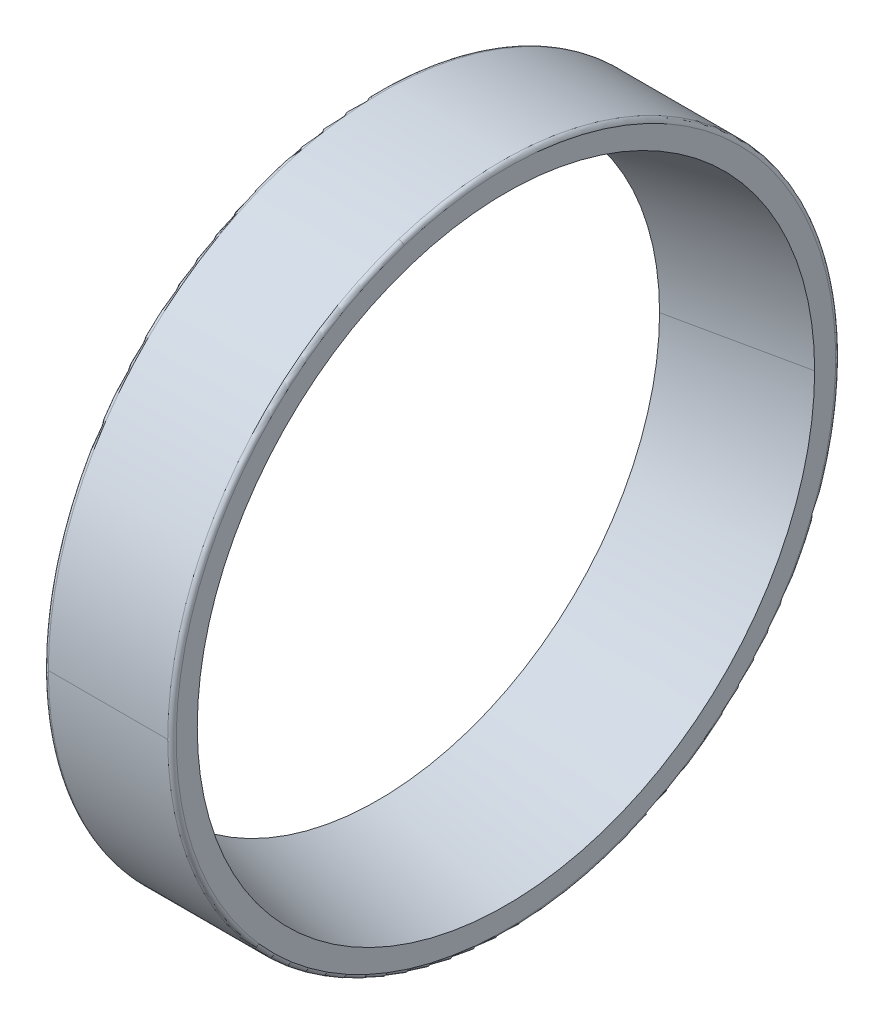
ISO-10303-21;
HEADER;
FILE_DESCRIPTION(('STEP AP214'),'2;1');
FILE_NAME('part.step','',(''),(''),'','','');
FILE_SCHEMA(('AUTOMOTIVE_DESIGN { 1 0 10303 214 1 1 1 1 }'));
ENDSEC;
DATA;
#1=APPLICATION_CONTEXT('core data for automotive mechanical design processes');
#2=APPLICATION_PROTOCOL_DEFINITION('international standard','automotive_design',2000,#1);
#3=PRODUCT_CONTEXT('',#1,'mechanical');
#4=PRODUCT('Part','Part','',(#3));
#5=PRODUCT_RELATED_PRODUCT_CATEGORY('part','',(#4));
#6=PRODUCT_DEFINITION_FORMATION('','',#4);
#7=PRODUCT_DEFINITION_CONTEXT('part definition',#1,'design');
#8=PRODUCT_DEFINITION('design','',#6,#7);
#9=PRODUCT_DEFINITION_SHAPE('','',#8);
#10=(LENGTH_UNIT() NAMED_UNIT(*) SI_UNIT(.MILLI.,.METRE.));
#11=(NAMED_UNIT(*) PLANE_ANGLE_UNIT() SI_UNIT($,.RADIAN.));
#12=(NAMED_UNIT(*) SI_UNIT($,.STERADIAN.) SOLID_ANGLE_UNIT());
#13=UNCERTAINTY_MEASURE_WITH_UNIT(LENGTH_MEASURE(1.E-05),#10,'distance_accuracy_value','');
#14=(GEOMETRIC_REPRESENTATION_CONTEXT(3) GLOBAL_UNCERTAINTY_ASSIGNED_CONTEXT((#13)) GLOBAL_UNIT_ASSIGNED_CONTEXT((#10,
#11,#12)) REPRESENTATION_CONTEXT('',''));
#15=CARTESIAN_POINT('',(0.,0.,0.));
#16=DIRECTION('',(0.,0.,1.));
#17=DIRECTION('',(1.,0.,0.));
#18=AXIS2_PLACEMENT_3D('',#15,#16,#17);
#19=CARTESIAN_POINT('',(-11.7000000000001,0.,0.));
#20=DIRECTION('',(1.,0.,0.));
#21=DIRECTION('',(0.,-0.309016994374947,0.951056516295154));
#22=AXIS2_PLACEMENT_3D('',#19,#20,#21);
#23=TOROIDAL_SURFACE('',#22,23.2,0.299999999999873);
#24=CARTESIAN_POINT('',(-11.7000000000001,-22.0645111780476,-7.16919426949878));
#25=DIRECTION('',(0.,0.309016994374946,-0.951056516295154));
#26=DIRECTION('',(3.9671969413289E-13,-0.951056516295154,-0.309016994374946));
#27=AXIS2_PLACEMENT_3D('',#24,#25,#26);
#28=CIRCLE('',#27,0.299999999999874);
#29=CARTESIAN_POINT('',(-11.7,-22.349828132936,-7.26189936781122));
#30=VERTEX_POINT('',#29);
#31=CARTESIAN_POINT('',(-12.,-22.0645111780476,-7.16919426949878));
#32=VERTEX_POINT('',#31);
#33=EDGE_CURVE('E10',#30,#32,#28,.T.);
#34=ORIENTED_EDGE('',*,*,#33,.T.);
#35=CARTESIAN_POINT('',(-12.,-22.0645111780475,-7.16919426949883));
#36=CARTESIAN_POINT('',(-12.,-21.9472130510089,-7.53022684233366));
#37=CARTESIAN_POINT('',(-12.,-21.8210390891849,-7.88837476117965));
#38=CARTESIAN_POINT('',(-12.,-21.5512765476478,-8.59805105823176));
#39=CARTESIAN_POINT('',(-12.,-21.4076879679346,-8.94957943643786));
#40=CARTESIAN_POINT('',(-12.,-21.1034332423005,-9.64516641954797));
#41=CARTESIAN_POINT('',(-12.,-20.9427670963796,-9.98922502445198));
#42=CARTESIAN_POINT('',(-12.,-20.6047466727279,-10.6690444966338));
#43=CARTESIAN_POINT('',(-12.,-20.4273923949972,-11.0048053639117));
#44=CARTESIAN_POINT('',(-12.,-20.0564223331806,-11.6672202415471));
#45=CARTESIAN_POINT('',(-12.,-19.8628065490948,-11.9938742519046));
#46=CARTESIAN_POINT('',(-12.,-19.4597800825097,-12.6372885424087));
#47=CARTESIAN_POINT('',(-12.,-19.2503694000103,-12.9540488225553));
#48=CARTESIAN_POINT('',(-12.,-18.8162575795734,-13.576912532006));
#49=CARTESIAN_POINT('',(-12.,-18.5915564416358,-13.8830159613102));
#50=CARTESIAN_POINT('',(-12.,-18.1274050472907,-14.4838285437582));
#51=CARTESIAN_POINT('',(-12.,-17.8879547908832,-14.778537696902));
#52=CARTESIAN_POINT('',(-12.,-17.3948820129581,-15.3558517456186));
#53=CARTESIAN_POINT('',(-12.,-17.1412594914406,-15.6384566411914));
#54=CARTESIAN_POINT('',(-12.,-16.6204531830436,-16.1908813551536));
#55=CARTESIAN_POINT('',(-12.,-16.3532693961642,-16.4607011735429));
#56=CARTESIAN_POINT('',(-12.,-15.8059842259532,-16.9869057134726));
#57=CARTESIAN_POINT('',(-12.,-15.5258828426215,-17.2432904350129));
#58=CARTESIAN_POINT('',(-12.,-14.9534372683355,-17.7420071280178));
#59=CARTESIAN_POINT('',(-12.,-14.6610930773811,-17.9843390994824));
#60=CARTESIAN_POINT('',(-12.,-14.0648661705951,-18.4543664933842));
#61=CARTESIAN_POINT('',(-12.,-13.7609834547634,-18.6820619158215));
#62=CARTESIAN_POINT('',(-12.,-13.1424115783068,-19.1222676734541));
#63=CARTESIAN_POINT('',(-12.,-12.8277224176817,-19.3347780086494));
#64=CARTESIAN_POINT('',(-12.,-12.1882957653886,-19.7441016357864));
#65=CARTESIAN_POINT('',(-12.,-11.8635582737205,-19.940914927728));
#66=CARTESIAN_POINT('',(-12.,-11.2048172804026,-20.3183703278988));
#67=CARTESIAN_POINT('',(-12.,-10.8708137787528,-20.4990124361279));
#68=CARTESIAN_POINT('',(-12.,-10.1943454091621,-20.8436902862124));
#69=CARTESIAN_POINT('',(-12.,-9.85188054122127,-21.0077260280677));
#70=CARTESIAN_POINT('',(-12.,-9.15931446691175,-21.3187959689348));
#71=CARTESIAN_POINT('',(-12.,-8.8092132605431,-21.4658301679465));
#72=CARTESIAN_POINT('',(-12.,-8.1022179338494,-21.742542804862));
#73=CARTESIAN_POINT('',(-12.,-7.74532381352434,-21.8722212427659));
#74=CARTESIAN_POINT('',(-12.,-7.02560244811392,-22.1139099507506));
#75=CARTESIAN_POINT('',(-12.,-6.66277520302856,-22.2259202208313));
#76=CARTESIAN_POINT('',(-12.,-5.93206167071085,-22.432002750618));
#77=CARTESIAN_POINT('',(-12.,-5.5641753834785,-22.5260750103239));
#78=CARTESIAN_POINT('',(-12.,-4.82423003715579,-22.6960548910478));
#79=CARTESIAN_POINT('',(-12.,-4.45217097806544,-22.7719625120656));
#80=CARTESIAN_POINT('',(-12.,-3.70477641088859,-22.9054302473054));
#81=CARTESIAN_POINT('',(-12.,-3.32944090280209,-22.9629903615273));
#82=CARTESIAN_POINT('',(-12.,-2.57639765374746,-23.0596244158185));
#83=CARTESIAN_POINT('',(-12.,-2.19868991277932,-23.0986983558877));
#84=CARTESIAN_POINT('',(-12.,-1.44181212899267,-23.1582659293294));
#85=CARTESIAN_POINT('',(-12.,-1.06264208617416,-23.1787595627018));
#86=CARTESIAN_POINT('',(-12.,-0.303753152531302,-23.201117151792));
#87=CARTESIAN_POINT('',(-12.,0.0759657382930412,-23.2029811075097));
#88=CARTESIAN_POINT('',(-12.,0.83503759188013,-23.1880748508581));
#89=CARTESIAN_POINT('',(-12.,1.21439055464287,-23.1713046384886));
#90=CARTESIAN_POINT('',(-12.,1.97181665759207,-23.1191704465729));
#91=CARTESIAN_POINT('',(-12.,2.34988979777853,-23.0838064670267));
#92=CARTESIAN_POINT('',(-12.,3.10384544426514,-22.9945699356818));
#93=CARTESIAN_POINT('',(-12.,3.47972795056529,-22.9406973838832));
#94=CARTESIAN_POINT('',(-12.,4.22839679539822,-22.8145734917293));
#95=CARTESIAN_POINT('',(-12.,4.60118313393098,-22.742322151374));
#96=CARTESIAN_POINT('',(-12.,5.34276156828737,-22.5796147419144));
#97=CARTESIAN_POINT('',(-12.,5.71155366411099,-22.4891586728101));
#98=CARTESIAN_POINT('',(-12.,6.44425516058787,-22.2902597224457));
#99=CARTESIAN_POINT('',(-12.,6.80816456124113,-22.1818168411857));
#100=CARTESIAN_POINT('',(-12.,7.53022397775642,-21.9472055149094));
#101=CARTESIAN_POINT('',(-12.,7.88837399361845,-21.8210370698932));
#102=CARTESIAN_POINT('',(-12.,8.59805182579284,-21.5512785669396));
#103=CARTESIAN_POINT('',(-12.,8.94957964210519,-21.4076885090022));
#104=CARTESIAN_POINT('',(-12.,9.64516621388053,-21.1034327012329));
#105=CARTESIAN_POINT('',(-12.,9.98922496934351,-20.942766951401));
#106=CARTESIAN_POINT('',(-12.,10.6690445517422,-20.6047468177066));
#107=CARTESIAN_POINT('',(-12.,11.0048053786779,-20.4273924338441));
#108=CARTESIAN_POINT('',(-12.,11.6672202267808,-20.0564222943337));
#109=CARTESIAN_POINT('',(-12.,11.9938742479479,-19.8628065386858));
#110=CARTESIAN_POINT('',(-12.,12.6372885463652,-19.4597800929187));
#111=CARTESIAN_POINT('',(-12.,12.9540488236154,-19.2503694027995));
#112=CARTESIAN_POINT('',(-12.,13.5769125309458,-18.8162575767844));
#113=CARTESIAN_POINT('',(-12.,13.8830159610261,-18.5915564408885));
#114=CARTESIAN_POINT('',(-12.,14.4838285440422,-18.1274050480381));
#115=CARTESIAN_POINT('',(-12.,14.778537696978,-17.8879547910835));
#116=CARTESIAN_POINT('',(-12.,15.3558517455424,-17.3948820127579));
#117=CARTESIAN_POINT('',(-12.,15.638456641171,-17.141259491387));
#118=CARTESIAN_POINT('',(-12.,16.1908813551739,-16.6204531830973));
#119=CARTESIAN_POINT('',(-12.,16.4607011735483,-16.3532693961787));
#120=CARTESIAN_POINT('',(-12.,16.9869057134671,-15.8059842259389));
#121=CARTESIAN_POINT('',(-12.,17.2432904350114,-15.5258828426177));
#122=CARTESIAN_POINT('',(-12.,17.7420071280193,-14.9534372683394));
#123=CARTESIAN_POINT('',(-12.,17.9843390994827,-14.6610930773822));
#124=CARTESIAN_POINT('',(-12.,18.4543664933838,-14.0648661705941));
#125=CARTESIAN_POINT('',(-12.,18.6820619158213,-13.7609834547632));
#126=CARTESIAN_POINT('',(-12.,19.1222676734541,-13.1424115783071));
#127=CARTESIAN_POINT('',(-12.,19.3347780086494,-12.8277224176819));
#128=CARTESIAN_POINT('',(-12.,19.7441016357863,-12.1882957653886));
#129=CARTESIAN_POINT('',(-12.,19.940914927728,-11.8635582737206));
#130=CARTESIAN_POINT('',(-12.,20.3183703278988,-11.2048172804027));
#131=CARTESIAN_POINT('',(-12.,20.4990124361279,-10.8708137787529));
#132=CARTESIAN_POINT('',(-12.,20.8436902862123,-10.1943454091622));
#133=CARTESIAN_POINT('',(-12.,21.0077260280677,-9.85188054122133));
#134=CARTESIAN_POINT('',(-12.,21.3187959689348,-9.1593144669118));
#135=CARTESIAN_POINT('',(-12.,21.4658301679465,-8.80921326054314));
#136=CARTESIAN_POINT('',(-12.,21.7425428048619,-8.10221793384948));
#137=CARTESIAN_POINT('',(-12.,21.8722212427656,-7.74532381352448));
#138=CARTESIAN_POINT('',(-12.,22.1139099507508,-7.02560244811391));
#139=CARTESIAN_POINT('',(-12.,22.2259202208323,-6.66277520302833));
#140=CARTESIAN_POINT('',(-12.,22.4320027506169,-5.9320616707112));
#141=CARTESIAN_POINT('',(-12.,22.5260750103199,-5.56417538347964));
#142=CARTESIAN_POINT('',(-12.,22.6960548910517,-4.82423003715478));
#143=CARTESIAN_POINT('',(-12.,22.7719625120804,-4.45217097806147));
#144=CARTESIAN_POINT('',(-12.,22.9054302472905,-3.70477641089268));
#145=CARTESIAN_POINT('',(-12.,22.9629903614719,-3.3294409028172));
#146=CARTESIAN_POINT('',(-12.,23.0596244158739,-2.57639765373249));
#147=CARTESIAN_POINT('',(-12.,23.0986983560945,-2.19868991272326));
#148=CARTESIAN_POINT('',(-12.,23.1582659291226,-1.44181212904886));
#149=CARTESIAN_POINT('',(-12.,23.1787595619302,-1.06264208638369));
#150=CARTESIAN_POINT('',(-12.,23.2011171525636,-0.30375315232193));
#151=CARTESIAN_POINT('',(-12.,23.2029811103893,0.0759657390746495));
#152=CARTESIAN_POINT('',(-12.,23.1880748479785,0.835037591098368));
#153=CARTESIAN_POINT('',(-12.,23.1713046277419,1.21439055172551));
#154=CARTESIAN_POINT('',(-12.,23.1191704573196,1.9718166605093));
#155=CARTESIAN_POINT('',(-12.,23.0838065071339,2.34988980866596));
#156=CARTESIAN_POINT('',(-12.,22.9945698955747,3.1038454333776));
#157=CARTESIAN_POINT('',(-12.,22.9406972342011,3.47972790993258));
#158=CARTESIAN_POINT('',(-12.,22.8145736414113,4.22839683603082));
#159=CARTESIAN_POINT('',(-12.,22.7423227099952,4.60118328557407));
#160=CARTESIAN_POINT('',(-12.,22.5796141832933,5.34276141664416));
#161=CARTESIAN_POINT('',(-12.,22.4891565880076,5.71155309817101));
#162=CARTESIAN_POINT('',(-12.,22.2902618072482,6.44425572652773));
#163=CARTESIAN_POINT('',(-12.,22.1818246217745,6.8081666733576));
#164=CARTESIAN_POINT('',(-12.,22.0645111780476,7.16919426949871));
#165=B_SPLINE_CURVE_WITH_KNOTS('',3,(#35,#36,#37,#38,#39,#40,#41,#42,#43,#44,#45,#46,#47,#48,
#49,#50,#51,#52,#53,#54,#55,#56,#57,#58,#59,#60,#61,#62,#63,#64,#65,#66,#67,#68,#69,#70,#71,#72,
#73,#74,#75,#76,#77,#78,#79,#80,#81,#82,#83,#84,#85,#86,#87,#88,#89,#90,#91,#92,#93,#94,#95,#96,
#97,#98,#99,#100,#101,#102,#103,#104,#105,#106,#107,#108,#109,#110,#111,#112,#113,#114,#115,
#116,#117,#118,#119,#120,#121,#122,#123,#124,#125,#126,#127,#128,#129,#130,#131,#132,#133,#134,
#135,#136,#137,#138,#139,#140,#141,#142,#143,#144,#145,#146,#147,#148,#149,#150,#151,#152,#153,
#154,#155,#156,#157,#158,#159,#160,#161,#162,#163,#164),.UNSPECIFIED.,.F.,.F.,(4,2,2,2,2,2,2,2,
2,2,2,2,2,2,2,2,2,2,2,2,2,2,2,2,2,2,2,2,2,2,2,2,2,2,2,2,2,2,2,2,2,2,2,2,2,2,2,2,2,2,2,2,2,2,2,2,
2,2,2,2,2,2,2,2,4),(0.,1.13871300346313,2.27742600692626,3.41613901038938,4.55485201385252,
5.69356501731564,6.83227802077877,7.97099102424189,9.10970402770503,10.2484170311682,
11.3871300346313,12.5258430380944,13.6645560415575,14.8032690450207,15.9419820484838,
17.0806950519469,18.21940805541,19.3581210588732,20.4968340623363,21.6355470657994,
22.7742600692626,23.9129730727257,25.0516860761888,26.1903990796519,27.3291120831151,
28.4678250865782,29.6065380900413,30.7452510935045,31.8839640969676,33.0226771004307,
34.1613901038938,35.300103107357,36.4388161108201,37.5775291142832,38.7162421177463,
39.8549551212095,40.9936681246726,42.1323811281357,43.2710941315989,44.409807135062,
45.5485201385251,46.6872331419882,47.8259461454514,48.9646591489145,50.1033721523776,
51.2420851558407,52.3807981593039,53.519511162767,54.6582241662301,55.7969371696933,
56.9356501731564,58.0743631766195,59.2130761800826,60.3517891835458,61.4905021870089,
62.629215190472,63.7679281939352,64.9066411973983,66.0453542008614,67.1840672043245,
68.3227802077877,69.4614932112508,70.6002062147139,71.7389192181771,72.8776322216402),.UNSPECIFIED.);
#166=CARTESIAN_POINT('',(-12.,22.0645111780476,7.16919426949878));
#167=VERTEX_POINT('',#166);
#168=EDGE_CURVE('E25',#32,#167,#165,.T.);
#169=ORIENTED_EDGE('',*,*,#168,.T.);
#170=CARTESIAN_POINT('',(-11.7000000000001,22.0645111780476,7.16919426949878));
#171=DIRECTION('',(0.,-0.309016994374946,0.951056516295154));
#172=DIRECTION('',(3.9671969413289E-13,0.951056516295154,0.309016994374946));
#173=AXIS2_PLACEMENT_3D('',#170,#171,#172);
#174=CIRCLE('',#173,0.299999999999874);
#175=CARTESIAN_POINT('',(-11.7,22.349828132936,7.26189936781122));
#176=VERTEX_POINT('',#175);
#177=EDGE_CURVE('E220',#176,#167,#174,.T.);
#178=ORIENTED_EDGE('',*,*,#177,.F.);
#179=CARTESIAN_POINT('',(-11.7,0.,0.));
#180=DIRECTION('',(1.,0.,0.));
#181=DIRECTION('',(0.,0.,-1.));
#182=AXIS2_PLACEMENT_3D('',#179,#180,#181);
#183=CIRCLE('',#182,23.5);
#184=CARTESIAN_POINT('',(-11.7,0.,-23.5));
#185=VERTEX_POINT('',#184);
#186=EDGE_CURVE('E215',#185,#176,#183,.T.);
#187=ORIENTED_EDGE('',*,*,#186,.F.);
#188=CARTESIAN_POINT('',(-11.7,0.,0.));
#189=DIRECTION('',(1.,0.,0.));
#190=DIRECTION('',(0.,0.,-1.));
#191=AXIS2_PLACEMENT_3D('',#188,#189,#190);
#192=CIRCLE('',#191,23.5);
#193=EDGE_CURVE('E210',#30,#185,#192,.T.);
#194=ORIENTED_EDGE('',*,*,#193,.F.);
#195=EDGE_LOOP('',(#34,#169,#178,#187,#194));
#196=FACE_BOUND('',#195,.T.);
#197=ADVANCED_FACE('F16',(#196),#23,.T.);
#198=CARTESIAN_POINT('',(-3.,0.,0.));
#199=DIRECTION('',(1.,0.,0.));
#200=DIRECTION('',(0.,1.,0.));
#201=AXIS2_PLACEMENT_3D('',#198,#199,#200);
#202=CYLINDRICAL_SURFACE('',#201,23.5);
#203=DIRECTION('',(1.,0.,0.));
#204=VECTOR('',#203,1.);
#205=CARTESIAN_POINT('',(-11.7,0.,23.5));
#206=LINE('',#205,#204);
#207=CARTESIAN_POINT('',(-11.7,0.,23.5));
#208=VERTEX_POINT('',#207);
#209=CARTESIAN_POINT('',(-3.3,0.,23.5));
#210=VERTEX_POINT('',#209);
#211=EDGE_CURVE('E205',#208,#210,#206,.T.);
#212=ORIENTED_EDGE('',*,*,#211,.F.);
#213=CARTESIAN_POINT('',(-11.7,0.,0.));
#214=DIRECTION('',(1.,0.,0.));
#215=DIRECTION('',(0.,0.,-1.));
#216=AXIS2_PLACEMENT_3D('',#213,#214,#215);
#217=CIRCLE('',#216,23.5);
#218=EDGE_CURVE('E200',#208,#30,#217,.T.);
#219=ORIENTED_EDGE('',*,*,#218,.T.);
#220=ORIENTED_EDGE('',*,*,#193,.T.);
#221=DIRECTION('',(1.,0.,0.));
#222=VECTOR('',#221,1.);
#223=CARTESIAN_POINT('',(-11.7,0.,-23.5));
#224=LINE('',#223,#222);
#225=CARTESIAN_POINT('',(-3.3,0.,-23.5));
#226=VERTEX_POINT('',#225);
#227=EDGE_CURVE('E196',#185,#226,#224,.T.);
#228=ORIENTED_EDGE('',*,*,#227,.T.);
#229=CARTESIAN_POINT('',(-3.3,0.,0.));
#230=DIRECTION('',(1.,0.,0.));
#231=DIRECTION('',(0.,0.,-1.));
#232=AXIS2_PLACEMENT_3D('',#229,#230,#231);
#233=CIRCLE('',#232,23.5);
#234=CARTESIAN_POINT('',(-3.3,-22.349828132936,-7.26189936781122));
#235=VERTEX_POINT('',#234);
#236=EDGE_CURVE('E191',#235,#226,#233,.T.);
#237=ORIENTED_EDGE('',*,*,#236,.F.);
#238=CARTESIAN_POINT('',(-3.3,0.,0.));
#239=DIRECTION('',(1.,0.,0.));
#240=DIRECTION('',(0.,0.,-1.));
#241=AXIS2_PLACEMENT_3D('',#238,#239,#240);
#242=CIRCLE('',#241,23.5);
#243=EDGE_CURVE('E186',#210,#235,#242,.T.);
#244=ORIENTED_EDGE('',*,*,#243,.F.);
#245=EDGE_LOOP('',(#212,#219,#220,#228,#237,#244));
#246=FACE_BOUND('',#245,.T.);
#247=ADVANCED_FACE('F241',(#246),#202,.T.);
#248=CARTESIAN_POINT('',(-3.29999999999988,0.,0.));
#249=DIRECTION('',(1.,0.,0.));
#250=DIRECTION('',(0.,0.309016994374947,-0.951056516295154));
#251=AXIS2_PLACEMENT_3D('',#248,#249,#250);
#252=TOROIDAL_SURFACE('',#251,23.2,0.299999999999879);
#253=CARTESIAN_POINT('',(-3.29999999999988,-22.0645111780476,-7.16919426949878));
#254=DIRECTION('',(0.,0.309016994374947,-0.951056516295154));
#255=DIRECTION('',(1.,0.,0.));
#256=AXIS2_PLACEMENT_3D('',#253,#254,#255);
#257=CIRCLE('',#256,0.299999999999879);
#258=CARTESIAN_POINT('',(-3.,-22.0645111780476,-7.16919426949878));
#259=VERTEX_POINT('',#258);
#260=EDGE_CURVE('E181',#259,#235,#257,.T.);
#261=ORIENTED_EDGE('',*,*,#260,.F.);
#262=CARTESIAN_POINT('',(-3.,0.,0.));
#263=DIRECTION('',(1.,0.,0.));
#264=DIRECTION('',(0.,0.,-1.));
#265=AXIS2_PLACEMENT_3D('',#262,#263,#264);
#266=CIRCLE('',#265,23.2);
#267=CARTESIAN_POINT('',(-3.,22.0645111780476,7.16919426949878));
#268=VERTEX_POINT('',#267);
#269=EDGE_CURVE('E176',#268,#259,#266,.T.);
#270=ORIENTED_EDGE('',*,*,#269,.F.);
#271=CARTESIAN_POINT('',(-3.29999999999988,22.0645111780476,7.16919426949878));
#272=DIRECTION('',(0.,-0.309016994374947,0.951056516295154));
#273=DIRECTION('',(1.,0.,0.));
#274=AXIS2_PLACEMENT_3D('',#271,#272,#273);
#275=CIRCLE('',#274,0.299999999999879);
#276=CARTESIAN_POINT('',(-3.3,22.349828132936,7.26189936781123));
#277=VERTEX_POINT('',#276);
#278=EDGE_CURVE('E172',#268,#277,#275,.T.);
#279=ORIENTED_EDGE('',*,*,#278,.T.);
#280=CARTESIAN_POINT('',(-3.3,0.,0.));
#281=DIRECTION('',(1.,0.,0.));
#282=DIRECTION('',(0.,0.,-1.));
#283=AXIS2_PLACEMENT_3D('',#280,#281,#282);
#284=CIRCLE('',#283,23.5);
#285=EDGE_CURVE('E167',#277,#210,#284,.T.);
#286=ORIENTED_EDGE('',*,*,#285,.T.);
#287=ORIENTED_EDGE('',*,*,#243,.T.);
#288=EDGE_LOOP('',(#261,#270,#279,#286,#287));
#289=FACE_BOUND('',#288,.T.);
#290=ADVANCED_FACE('F243',(#289),#252,.T.);
#291=CARTESIAN_POINT('',(-3.,0.,0.));
#292=DIRECTION('',(1.,0.,0.));
#293=DIRECTION('',(0.,-1.,0.));
#294=AXIS2_PLACEMENT_3D('',#291,#292,#293);
#295=CYLINDRICAL_SURFACE('',#294,23.5);
#296=ORIENTED_EDGE('',*,*,#211,.T.);
#297=ORIENTED_EDGE('',*,*,#285,.F.);
#298=CARTESIAN_POINT('',(-3.3,0.,0.));
#299=DIRECTION('',(1.,0.,0.));
#300=DIRECTION('',(0.,0.,-1.));
#301=AXIS2_PLACEMENT_3D('',#298,#299,#300);
#302=CIRCLE('',#301,23.5);
#303=EDGE_CURVE('E162',#226,#277,#302,.T.);
#304=ORIENTED_EDGE('',*,*,#303,.F.);
#305=ORIENTED_EDGE('',*,*,#227,.F.);
#306=ORIENTED_EDGE('',*,*,#186,.T.);
#307=CARTESIAN_POINT('',(-11.7,0.,0.));
#308=DIRECTION('',(1.,0.,0.));
#309=DIRECTION('',(0.,0.,-1.));
#310=AXIS2_PLACEMENT_3D('',#307,#308,#309);
#311=CIRCLE('',#310,23.5);
#312=EDGE_CURVE('E159',#176,#208,#311,.T.);
#313=ORIENTED_EDGE('',*,*,#312,.T.);
#314=EDGE_LOOP('',(#296,#297,#304,#305,#306,#313));
#315=FACE_BOUND('',#314,.T.);
#316=ADVANCED_FACE('F237',(#315),#295,.T.);
#317=CARTESIAN_POINT('',(-11.7000000000001,0.,0.));
#318=DIRECTION('',(1.,0.,0.));
#319=DIRECTION('',(0.,0.309016994374947,-0.951056516295154));
#320=AXIS2_PLACEMENT_3D('',#317,#318,#319);
#321=TOROIDAL_SURFACE('',#320,23.2,0.299999999999873);
#322=ORIENTED_EDGE('',*,*,#33,.F.);
#323=ORIENTED_EDGE('',*,*,#218,.F.);
#324=ORIENTED_EDGE('',*,*,#312,.F.);
#325=ORIENTED_EDGE('',*,*,#177,.T.);
#326=CARTESIAN_POINT('',(-12.,22.0645111780475,7.16919426949884));
#327=CARTESIAN_POINT('',(-12.,21.9472130510089,7.53022684233366));
#328=CARTESIAN_POINT('',(-12.,21.8210390891849,7.88837476117966));
#329=CARTESIAN_POINT('',(-12.,21.5512765476478,8.59805105823176));
#330=CARTESIAN_POINT('',(-12.,21.4076879679346,8.94957943643787));
#331=CARTESIAN_POINT('',(-12.,21.1034332423005,9.64516641954798));
#332=CARTESIAN_POINT('',(-12.,20.9427670963796,9.98922502445198));
#333=CARTESIAN_POINT('',(-12.,20.6047466727279,10.6690444966338));
#334=CARTESIAN_POINT('',(-12.,20.4273923949971,11.0048053639117));
#335=CARTESIAN_POINT('',(-12.,20.0564223331806,11.6672202415471));
#336=CARTESIAN_POINT('',(-12.,19.8628065490948,11.9938742519046));
#337=CARTESIAN_POINT('',(-12.,19.4597800825097,12.6372885424087));
#338=CARTESIAN_POINT('',(-12.,19.2503694000103,12.9540488225553));
#339=CARTESIAN_POINT('',(-12.,18.8162575795734,13.576912532006));
#340=CARTESIAN_POINT('',(-12.,18.5915564416358,13.8830159613102));
#341=CARTESIAN_POINT('',(-12.,18.1274050472907,14.4838285437582));
#342=CARTESIAN_POINT('',(-12.,17.8879547908832,14.778537696902));
#343=CARTESIAN_POINT('',(-12.,17.3948820129581,15.3558517456186));
#344=CARTESIAN_POINT('',(-12.,17.1412594914406,15.6384566411914));
#345=CARTESIAN_POINT('',(-12.,16.6204531830436,16.1908813551536));
#346=CARTESIAN_POINT('',(-12.,16.3532693961642,16.4607011735429));
#347=CARTESIAN_POINT('',(-12.,15.8059842259532,16.9869057134726));
#348=CARTESIAN_POINT('',(-12.,15.5258828426215,17.243290435013));
#349=CARTESIAN_POINT('',(-12.,14.9534372683355,17.7420071280179));
#350=CARTESIAN_POINT('',(-12.,14.6610930773811,17.9843390994824));
#351=CARTESIAN_POINT('',(-12.,14.0648661705951,18.4543664933842));
#352=CARTESIAN_POINT('',(-12.,13.7609834547634,18.6820619158215));
#353=CARTESIAN_POINT('',(-12.,13.1424115783067,19.1222676734541));
#354=CARTESIAN_POINT('',(-12.,12.8277224176817,19.3347780086494));
#355=CARTESIAN_POINT('',(-12.,12.1882957653886,19.7441016357864));
#356=CARTESIAN_POINT('',(-12.,11.8635582737205,19.9409149277281));
#357=CARTESIAN_POINT('',(-12.,11.2048172804026,20.3183703278988));
#358=CARTESIAN_POINT('',(-12.,10.8708137787528,20.4990124361279));
#359=CARTESIAN_POINT('',(-12.,10.1943454091621,20.8436902862124));
#360=CARTESIAN_POINT('',(-12.,9.85188054122125,21.0077260280677));
#361=CARTESIAN_POINT('',(-12.,9.15931446691173,21.3187959689348));
#362=CARTESIAN_POINT('',(-12.,8.80921326054308,21.4658301679465));
#363=CARTESIAN_POINT('',(-12.,8.10221793384937,21.742542804862));
#364=CARTESIAN_POINT('',(-12.,7.74532381352432,21.8722212427659));
#365=CARTESIAN_POINT('',(-12.,7.0256024481139,22.1139099507506));
#366=CARTESIAN_POINT('',(-12.,6.66277520302854,22.2259202208313));
#367=CARTESIAN_POINT('',(-12.,5.93206167071082,22.432002750618));
#368=CARTESIAN_POINT('',(-12.,5.56417538347848,22.526075010324));
#369=CARTESIAN_POINT('',(-12.,4.82423003715577,22.6960548910478));
#370=CARTESIAN_POINT('',(-12.,4.45217097806541,22.7719625120656));
#371=CARTESIAN_POINT('',(-12.,3.70477641088856,22.9054302473054));
#372=CARTESIAN_POINT('',(-12.,3.32944090280206,22.9629903615273));
#373=CARTESIAN_POINT('',(-12.,2.57639765374743,23.0596244158185));
#374=CARTESIAN_POINT('',(-12.,2.19868991277929,23.0986983558878));
#375=CARTESIAN_POINT('',(-12.,1.44181212899264,23.1582659293294));
#376=CARTESIAN_POINT('',(-12.,1.06264208617413,23.1787595627018));
#377=CARTESIAN_POINT('',(-12.,0.303753152531276,23.201117151792));
#378=CARTESIAN_POINT('',(-12.,-0.0759657382930713,23.2029811075097));
#379=CARTESIAN_POINT('',(-12.,-0.835037591880163,23.1880748508581));
#380=CARTESIAN_POINT('',(-12.,-1.21439055464291,23.1713046384886));
#381=CARTESIAN_POINT('',(-12.,-1.97181665759211,23.1191704465729));
#382=CARTESIAN_POINT('',(-12.,-2.34988979777857,23.0838064670267));
#383=CARTESIAN_POINT('',(-12.,-3.10384544426518,22.9945699356818));
#384=CARTESIAN_POINT('',(-12.,-3.47972795056534,22.9406973838832));
#385=CARTESIAN_POINT('',(-12.,-4.22839679539826,22.8145734917292));
#386=CARTESIAN_POINT('',(-12.,-4.60118313393103,22.742322151374));
#387=CARTESIAN_POINT('',(-12.,-5.34276156828741,22.5796147419144));
#388=CARTESIAN_POINT('',(-12.,-5.71155366411103,22.4891586728101));
#389=CARTESIAN_POINT('',(-12.,-6.44425516058791,22.2902597224457));
#390=CARTESIAN_POINT('',(-12.,-6.80816456124117,22.1818168411857));
#391=CARTESIAN_POINT('',(-12.,-7.53022397775646,21.9472055149094));
#392=CARTESIAN_POINT('',(-12.,-7.8883739936185,21.8210370698932));
#393=CARTESIAN_POINT('',(-12.,-8.59805182579288,21.5512785669396));
#394=CARTESIAN_POINT('',(-12.,-8.94957964210523,21.4076885090022));
#395=CARTESIAN_POINT('',(-12.,-9.64516621388057,21.1034327012329));
#396=CARTESIAN_POINT('',(-12.,-9.98922496934355,20.942766951401));
#397=CARTESIAN_POINT('',(-12.,-10.6690445517422,20.6047468177066));
#398=CARTESIAN_POINT('',(-12.,-11.0048053786779,20.4273924338441));
#399=CARTESIAN_POINT('',(-12.,-11.6672202267808,20.0564222943337));
#400=CARTESIAN_POINT('',(-12.,-11.993874247948,19.8628065386858));
#401=CARTESIAN_POINT('',(-12.,-12.6372885463653,19.4597800929187));
#402=CARTESIAN_POINT('',(-12.,-12.9540488236154,19.2503694027994));
#403=CARTESIAN_POINT('',(-12.,-13.5769125309458,18.8162575767844));
#404=CARTESIAN_POINT('',(-12.,-13.8830159610261,18.5915564408885));
#405=CARTESIAN_POINT('',(-12.,-14.4838285440422,18.1274050480381));
#406=CARTESIAN_POINT('',(-12.,-14.7785376969781,17.8879547910835));
#407=CARTESIAN_POINT('',(-12.,-15.3558517455425,17.3948820127579));
#408=CARTESIAN_POINT('',(-12.,-15.638456641171,17.1412594913869));
#409=CARTESIAN_POINT('',(-12.,-16.190881355174,16.6204531830973));
#410=CARTESIAN_POINT('',(-12.,-16.4607011735484,16.3532693961786));
#411=CARTESIAN_POINT('',(-12.,-16.9869057134671,15.8059842259388));
#412=CARTESIAN_POINT('',(-12.,-17.2432904350115,15.5258828426177));
#413=CARTESIAN_POINT('',(-12.,-17.7420071280193,14.9534372683394));
#414=CARTESIAN_POINT('',(-12.,-17.9843390994828,14.6610930773822));
#415=CARTESIAN_POINT('',(-12.,-18.4543664933838,14.0648661705941));
#416=CARTESIAN_POINT('',(-12.,-18.6820619158214,13.7609834547632));
#417=CARTESIAN_POINT('',(-12.,-19.1222676734542,13.142411578307));
#418=CARTESIAN_POINT('',(-12.,-19.3347780086494,12.8277224176818));
#419=CARTESIAN_POINT('',(-12.,-19.7441016357863,12.1882957653886));
#420=CARTESIAN_POINT('',(-12.,-19.940914927728,11.8635582737205));
#421=CARTESIAN_POINT('',(-12.,-20.3183703278988,11.2048172804026));
#422=CARTESIAN_POINT('',(-12.,-20.4990124361279,10.8708137787528));
#423=CARTESIAN_POINT('',(-12.,-20.8436902862124,10.1943454091621));
#424=CARTESIAN_POINT('',(-12.,-21.0077260280677,9.85188054122127));
#425=CARTESIAN_POINT('',(-12.,-21.3187959689348,9.15931446691174));
#426=CARTESIAN_POINT('',(-12.,-21.4658301679465,8.80921326054308));
#427=CARTESIAN_POINT('',(-12.,-21.742542804862,8.10221793384942));
#428=CARTESIAN_POINT('',(-12.,-21.8722212427657,7.74532381352442));
#429=CARTESIAN_POINT('',(-12.,-22.1139099507508,7.02560244811384));
#430=CARTESIAN_POINT('',(-12.,-22.2259202208323,6.66277520302827));
#431=CARTESIAN_POINT('',(-12.,-22.4320027506169,5.93206167071114));
#432=CARTESIAN_POINT('',(-12.,-22.52607501032,5.56417538347958));
#433=CARTESIAN_POINT('',(-12.,-22.6960548910517,4.82423003715471));
#434=CARTESIAN_POINT('',(-12.,-22.7719625120804,4.45217097806141));
#435=CARTESIAN_POINT('',(-12.,-22.9054302472905,3.70477641089261));
#436=CARTESIAN_POINT('',(-12.,-22.9629903614719,3.32944090281712));
#437=CARTESIAN_POINT('',(-12.,-23.0596244158739,2.5763976537324));
#438=CARTESIAN_POINT('',(-12.,-23.0986983560945,2.19868991272318));
#439=CARTESIAN_POINT('',(-12.,-23.1582659291226,1.44181212904878));
#440=CARTESIAN_POINT('',(-12.,-23.1787595619302,1.0626420863836));
#441=CARTESIAN_POINT('',(-12.,-23.2011171525636,0.303753152321846));
#442=CARTESIAN_POINT('',(-12.,-23.2029811103893,-0.075965739074735));
#443=CARTESIAN_POINT('',(-12.,-23.1880748479785,-0.835037591098454));
#444=CARTESIAN_POINT('',(-12.,-23.1713046277419,-1.21439055172559));
#445=CARTESIAN_POINT('',(-12.,-23.1191704573196,-1.97181666050939));
#446=CARTESIAN_POINT('',(-12.,-23.0838065071339,-2.34988980866604));
#447=CARTESIAN_POINT('',(-12.,-22.9945698955747,-3.10384543337768));
#448=CARTESIAN_POINT('',(-12.,-22.9406972342011,-3.47972790993267));
#449=CARTESIAN_POINT('',(-12.,-22.8145736414113,-4.2283968360309));
#450=CARTESIAN_POINT('',(-12.,-22.7423227099952,-4.60118328557415));
#451=CARTESIAN_POINT('',(-12.,-22.5796141832933,-5.34276141664425));
#452=CARTESIAN_POINT('',(-12.,-22.4891565880076,-5.71155309817109));
#453=CARTESIAN_POINT('',(-12.,-22.2902618072482,-6.44425572652781));
#454=CARTESIAN_POINT('',(-12.,-22.1818246217745,-6.80816667335768));
#455=CARTESIAN_POINT('',(-12.,-22.0645111780476,-7.16919426949879));
#456=B_SPLINE_CURVE_WITH_KNOTS('',3,(#326,#327,#328,#329,#330,#331,#332,#333,#334,#335,#336,
#337,#338,#339,#340,#341,#342,#343,#344,#345,#346,#347,#348,#349,#350,#351,#352,#353,#354,#355,
#356,#357,#358,#359,#360,#361,#362,#363,#364,#365,#366,#367,#368,#369,#370,#371,#372,#373,#374,
#375,#376,#377,#378,#379,#380,#381,#382,#383,#384,#385,#386,#387,#388,#389,#390,#391,#392,#393,
#394,#395,#396,#397,#398,#399,#400,#401,#402,#403,#404,#405,#406,#407,#408,#409,#410,#411,#412,
#413,#414,#415,#416,#417,#418,#419,#420,#421,#422,#423,#424,#425,#426,#427,#428,#429,#430,#431,
#432,#433,#434,#435,#436,#437,#438,#439,#440,#441,#442,#443,#444,#445,#446,#447,#448,#449,#450,
#451,#452,#453,#454,#455),.UNSPECIFIED.,.F.,.F.,(4,2,2,2,2,2,2,2,2,2,2,2,2,2,2,2,2,2,2,2,2,2,2,
2,2,2,2,2,2,2,2,2,2,2,2,2,2,2,2,2,2,2,2,2,2,2,2,2,2,2,2,2,2,2,2,2,2,2,2,2,2,2,2,2,4),(0.,
1.13871300346313,2.27742600692626,3.41613901038939,4.55485201385252,5.69356501731565,
6.83227802077878,7.9709910242419,9.10970402770504,10.2484170311682,11.3871300346313,
12.5258430380944,13.6645560415576,14.8032690450207,15.9419820484838,17.0806950519469,
18.2194080554101,19.3581210588732,20.4968340623363,21.6355470657995,22.7742600692626,
23.9129730727257,25.0516860761889,26.190399079652,27.3291120831151,28.4678250865782,
29.6065380900414,30.7452510935045,31.8839640969676,33.0226771004308,34.1613901038939,
35.300103107357,36.4388161108201,37.5775291142833,38.7162421177464,39.8549551212095,
40.9936681246727,42.1323811281358,43.2710941315989,44.409807135062,45.5485201385252,
46.6872331419883,47.8259461454514,48.9646591489146,50.1033721523777,51.2420851558408,
52.380798159304,53.5195111627671,54.6582241662302,55.7969371696934,56.9356501731565,
58.0743631766196,59.2130761800827,60.3517891835459,61.490502187009,62.6292151904721,
63.7679281939353,64.9066411973984,66.0453542008615,67.1840672043246,68.3227802077878,
69.4614932112509,70.6002062147141,71.7389192181772,72.8776322216403),.UNSPECIFIED.);
#457=EDGE_CURVE('E145',#167,#32,#456,.T.);
#458=ORIENTED_EDGE('',*,*,#457,.T.);
#459=EDGE_LOOP('',(#322,#323,#324,#325,#458));
#460=FACE_BOUND('',#459,.T.);
#461=ADVANCED_FACE('F125',(#460),#321,.T.);
#462=CARTESIAN_POINT('',(-12.,23.2,0.));
#463=DIRECTION('',(-1.,0.,0.));
#464=DIRECTION('',(0.,0.,1.));
#465=AXIS2_PLACEMENT_3D('',#462,#463,#464);
#466=PLANE('',#465);
#467=CARTESIAN_POINT('',(-12.,0.,0.));
#468=DIRECTION('',(1.,0.,0.));
#469=DIRECTION('',(0.,0.,-1.));
#470=AXIS2_PLACEMENT_3D('',#467,#468,#469);
#471=CIRCLE('',#470,19.8085);
#472=CARTESIAN_POINT('',(-12.,0.,-19.8085));
#473=VERTEX_POINT('',#472);
#474=CARTESIAN_POINT('',(-12.,0.,19.8085));
#475=VERTEX_POINT('',#474);
#476=EDGE_CURVE('E97',#473,#475,#471,.T.);
#477=ORIENTED_EDGE('',*,*,#476,.T.);
#478=CARTESIAN_POINT('',(-12.,0.,0.));
#479=DIRECTION('',(1.,0.,0.));
#480=DIRECTION('',(0.,0.,-1.));
#481=AXIS2_PLACEMENT_3D('',#478,#479,#480);
#482=CIRCLE('',#481,19.8085);
#483=EDGE_CURVE('E107',#475,#473,#482,.T.);
#484=ORIENTED_EDGE('',*,*,#483,.T.);
#485=EDGE_LOOP('',(#477,#484));
#486=FACE_BOUND('',#485,.T.);
#487=ORIENTED_EDGE('',*,*,#168,.F.);
#488=ORIENTED_EDGE('',*,*,#457,.F.);
#489=EDGE_LOOP('',(#487,#488));
#490=FACE_BOUND('',#489,.T.);
#491=ADVANCED_FACE('F115',(#486,#490),#466,.T.);
#492=CARTESIAN_POINT('',(-12.,0.,0.));
#493=DIRECTION('',(1.,0.,0.));
#494=DIRECTION('',(0.,1.,0.));
#495=AXIS2_PLACEMENT_3D('',#492,#493,#494);
#496=CONICAL_SURFACE('',#495,19.8085,0.209438547616239);
#497=DIRECTION('',(0.978147800873945,0.,0.207910749230206));
#498=VECTOR('',#497,1.);
#499=CARTESIAN_POINT('',(-12.,0.,19.8085));
#500=LINE('',#499,#498);
#501=CARTESIAN_POINT('',(-3.,0.,21.7215));
#502=VERTEX_POINT('',#501);
#503=EDGE_CURVE('E87',#475,#502,#500,.T.);
#504=ORIENTED_EDGE('',*,*,#503,.T.);
#505=CARTESIAN_POINT('',(-3.,0.,0.));
#506=DIRECTION('',(1.,0.,0.));
#507=DIRECTION('',(0.,0.,-1.));
#508=AXIS2_PLACEMENT_3D('',#505,#506,#507);
#509=CIRCLE('',#508,21.7215);
#510=CARTESIAN_POINT('',(-3.,0.,-21.7215));
#511=VERTEX_POINT('',#510);
#512=EDGE_CURVE('E79',#502,#511,#509,.T.);
#513=ORIENTED_EDGE('',*,*,#512,.T.);
#514=DIRECTION('',(0.978147800873945,0.,-0.207910749230206));
#515=VECTOR('',#514,1.);
#516=CARTESIAN_POINT('',(-12.,0.,-19.8085));
#517=LINE('',#516,#515);
#518=EDGE_CURVE('E84',#473,#511,#517,.T.);
#519=ORIENTED_EDGE('',*,*,#518,.F.);
#520=ORIENTED_EDGE('',*,*,#483,.F.);
#521=EDGE_LOOP('',(#504,#513,#519,#520));
#522=FACE_BOUND('',#521,.T.);
#523=ADVANCED_FACE('F81',(#522),#496,.F.);
#524=CARTESIAN_POINT('',(-12.,0.,0.));
#525=DIRECTION('',(1.,0.,0.));
#526=DIRECTION('',(0.,-1.,0.));
#527=AXIS2_PLACEMENT_3D('',#524,#525,#526);
#528=CONICAL_SURFACE('',#527,19.8085,0.209438547616239);
#529=ORIENTED_EDGE('',*,*,#503,.F.);
#530=ORIENTED_EDGE('',*,*,#476,.F.);
#531=ORIENTED_EDGE('',*,*,#518,.T.);
#532=CARTESIAN_POINT('',(-3.,0.,0.));
#533=DIRECTION('',(1.,0.,0.));
#534=DIRECTION('',(0.,0.,-1.));
#535=AXIS2_PLACEMENT_3D('',#532,#533,#534);
#536=CIRCLE('',#535,21.7215);
#537=EDGE_CURVE('E91',#511,#502,#536,.T.);
#538=ORIENTED_EDGE('',*,*,#537,.T.);
#539=EDGE_LOOP('',(#529,#530,#531,#538));
#540=FACE_BOUND('',#539,.T.);
#541=ADVANCED_FACE('F96',(#540),#528,.F.);
#542=CARTESIAN_POINT('',(-3.,21.7215,0.));
#543=DIRECTION('',(1.,0.,0.));
#544=DIRECTION('',(0.,0.,-1.));
#545=AXIS2_PLACEMENT_3D('',#542,#543,#544);
#546=PLANE('',#545);
#547=ORIENTED_EDGE('',*,*,#269,.T.);
#548=CARTESIAN_POINT('',(-3.,-22.0645111780476,-7.16919426949878));
#549=CARTESIAN_POINT('',(-3.,-20.9383310363497,-10.6350471512942));
#550=CARTESIAN_POINT('',(-3.,-19.1319125612291,-13.8799852663391));
#551=CARTESIAN_POINT('',(-3.,-16.7019096441638,-16.7249997963395));
#552=CARTESIAN_POINT('',(-3.,-10.8573669527925,-21.3087743139292));
#553=CARTESIAN_POINT('',(-3.,-3.71367482608119,-23.3428570204827));
#554=CARTESIAN_POINT('',(-3.,0.0163280948842943,-23.6364209774511));
#555=CARTESIAN_POINT('',(-3.,7.39025951091786,-22.7448800322048));
#556=CARTESIAN_POINT('',(-3.,13.8799299612751,-19.1318636703295));
#557=CARTESIAN_POINT('',(-3.,16.7250131488936,-16.7019247322547));
#558=CARTESIAN_POINT('',(-3.,21.3087776651303,-10.85736037569));
#559=CARTESIAN_POINT('',(-3.,23.3428369655263,-3.71367289219535));
#560=CARTESIAN_POINT('',(-3.,23.6364930385209,0.0163120894974451));
#561=CARTESIAN_POINT('',(-3.,23.1905895152211,3.70330830940826));
#562=CARTESIAN_POINT('',(-3.,22.0645111780476,7.16919426949877));
#563=B_SPLINE_CURVE_WITH_KNOTS('',5,(#548,#549,#550,#551,#552,#553,#554,#555,#556,#557,#558,
#559,#560,#561,#562),.UNSPECIFIED.,.F.,.F.,(6,3,3,3,6),(0.,0.785398163397448,1.5707963267949,
2.35619449019234,3.14159265358979),.UNSPECIFIED.);
#564=EDGE_CURVE('E94',#259,#268,#563,.T.);
#565=ORIENTED_EDGE('',*,*,#564,.T.);
#566=EDGE_LOOP('',(#547,#565));
#567=FACE_BOUND('',#566,.T.);
#568=ORIENTED_EDGE('',*,*,#512,.F.);
#569=ORIENTED_EDGE('',*,*,#537,.F.);
#570=EDGE_LOOP('',(#568,#569));
#571=FACE_BOUND('',#570,.T.);
#572=ADVANCED_FACE('F92',(#567,#571),#546,.T.);
#573=CARTESIAN_POINT('',(-3.29999999999988,0.,0.));
#574=DIRECTION('',(1.,0.,0.));
#575=DIRECTION('',(0.,-0.309016994374947,0.951056516295154));
#576=AXIS2_PLACEMENT_3D('',#573,#574,#575);
#577=TOROIDAL_SURFACE('',#576,23.2,0.299999999999879);
#578=ORIENTED_EDGE('',*,*,#260,.T.);
#579=ORIENTED_EDGE('',*,*,#236,.T.);
#580=ORIENTED_EDGE('',*,*,#303,.T.);
#581=ORIENTED_EDGE('',*,*,#278,.F.);
#582=ORIENTED_EDGE('',*,*,#564,.F.);
#583=EDGE_LOOP('',(#578,#579,#580,#581,#582));
#584=FACE_BOUND('',#583,.T.);
#585=ADVANCED_FACE('F248',(#584),#577,.T.);
#586=CLOSED_SHELL('',(#197,#247,#290,#316,#461,#491,#523,#541,#572,#585));
#587=MANIFOLD_SOLID_BREP('B1',#586);
#588=ADVANCED_BREP_SHAPE_REPRESENTATION('',(#18,#587),#14);
#589=SHAPE_DEFINITION_REPRESENTATION(#9,#588);
ENDSEC;
END-ISO-10303-21;
